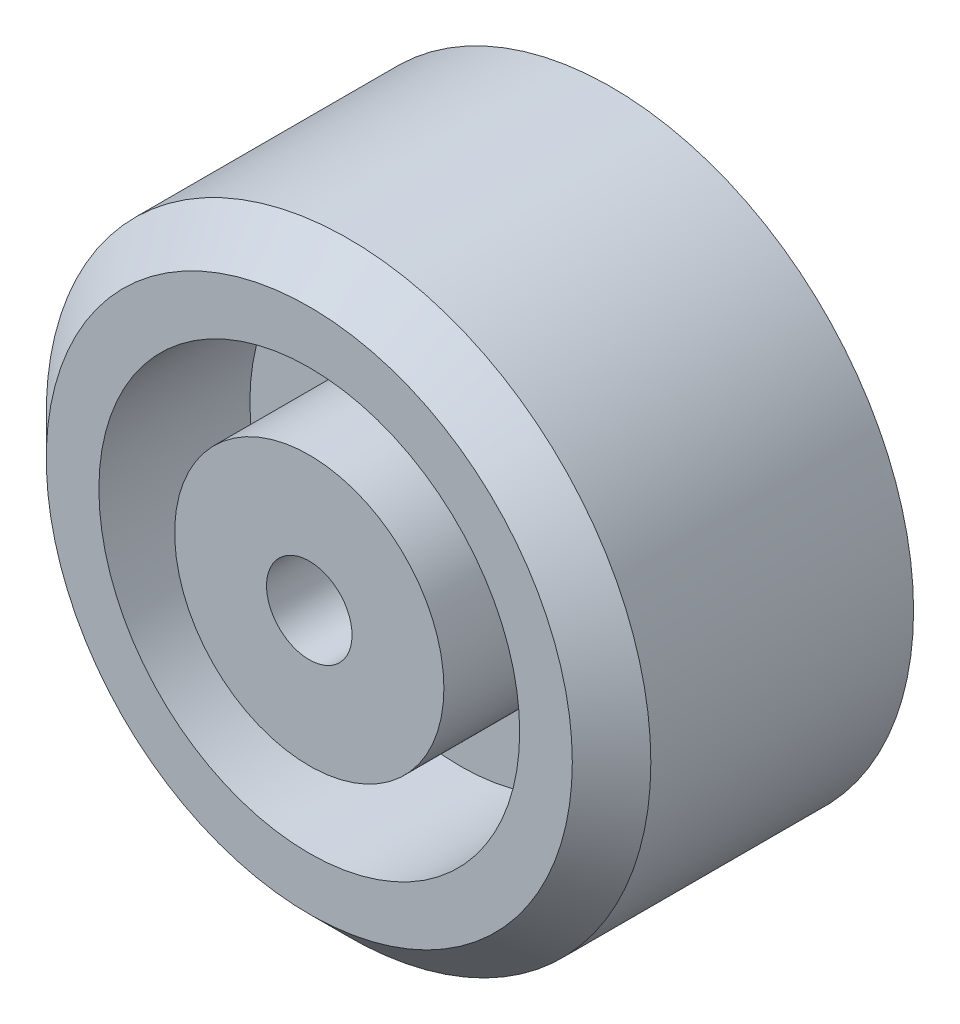
ISO-10303-21;
HEADER;
FILE_DESCRIPTION(('STEP AP214'),'2;1');
FILE_NAME('part.step','',(''),(''),'','','');
FILE_SCHEMA(('AUTOMOTIVE_DESIGN { 1 0 10303 214 1 1 1 1 }'));
ENDSEC;
DATA;
#1=APPLICATION_CONTEXT('core data for automotive mechanical design processes');
#2=APPLICATION_PROTOCOL_DEFINITION('international standard','automotive_design',2000,#1);
#3=PRODUCT_CONTEXT('',#1,'mechanical');
#4=PRODUCT('Part','Part','',(#3));
#5=PRODUCT_RELATED_PRODUCT_CATEGORY('part','',(#4));
#6=PRODUCT_DEFINITION_FORMATION('','',#4);
#7=PRODUCT_DEFINITION_CONTEXT('part definition',#1,'design');
#8=PRODUCT_DEFINITION('design','',#6,#7);
#9=PRODUCT_DEFINITION_SHAPE('','',#8);
#10=(LENGTH_UNIT() NAMED_UNIT(*) SI_UNIT(.MILLI.,.METRE.));
#11=(NAMED_UNIT(*) PLANE_ANGLE_UNIT() SI_UNIT($,.RADIAN.));
#12=(NAMED_UNIT(*) SI_UNIT($,.STERADIAN.) SOLID_ANGLE_UNIT());
#13=UNCERTAINTY_MEASURE_WITH_UNIT(LENGTH_MEASURE(1.E-05),#10,'distance_accuracy_value','');
#14=(GEOMETRIC_REPRESENTATION_CONTEXT(3) GLOBAL_UNCERTAINTY_ASSIGNED_CONTEXT((#13)) GLOBAL_UNIT_ASSIGNED_CONTEXT((#10,
#11,#12)) REPRESENTATION_CONTEXT('',''));
#15=CARTESIAN_POINT('',(0.,0.,0.));
#16=DIRECTION('',(0.,0.,1.));
#17=DIRECTION('',(1.,0.,0.));
#18=AXIS2_PLACEMENT_3D('',#15,#16,#17);
#19=CARTESIAN_POINT('',(-9.1006627591492,10.6632075471698,10.));
#20=DIRECTION('',(0.,0.,1.));
#21=DIRECTION('',(1.,0.,0.));
#22=AXIS2_PLACEMENT_3D('',#19,#20,#21);
#23=PLANE('',#22);
#24=CARTESIAN_POINT('',(-9.1006627591492,10.6632075471698,10.));
#25=DIRECTION('',(0.,0.,1.));
#26=DIRECTION('',(1.,0.,0.));
#27=AXIS2_PLACEMENT_3D('',#24,#25,#26);
#28=CIRCLE('',#27,1.41539314546252);
#29=CARTESIAN_POINT('',(-7.68526961368668,10.6632075471698,10.));
#30=VERTEX_POINT('',#29);
#31=EDGE_CURVE('E46',#30,#30,#28,.T.);
#32=ORIENTED_EDGE('',*,*,#31,.F.);
#33=EDGE_LOOP('',(#32));
#34=FACE_BOUND('',#33,.T.);
#35=CARTESIAN_POINT('',(-9.1006627591492,10.6632075471698,10.));
#36=DIRECTION('',(0.,0.,1.));
#37=DIRECTION('',(1.,0.,0.));
#38=AXIS2_PLACEMENT_3D('',#35,#36,#37);
#39=CIRCLE('',#38,4.45751214195865);
#40=CARTESIAN_POINT('',(-4.64315061719055,10.6632075471698,10.));
#41=VERTEX_POINT('',#40);
#42=EDGE_CURVE('E61',#41,#41,#39,.T.);
#43=ORIENTED_EDGE('',*,*,#42,.T.);
#44=EDGE_LOOP('',(#43));
#45=FACE_BOUND('',#44,.T.);
#46=ADVANCED_FACE('F31',(#34,#45),#23,.T.);
#47=CARTESIAN_POINT('',(-9.1006627591492,10.6632075471698,10.));
#48=DIRECTION('',(0.,0.,1.));
#49=DIRECTION('',(1.,0.,0.));
#50=AXIS2_PLACEMENT_3D('',#47,#48,#49);
#51=CIRCLE('',#50,8.70980384499657);
#52=CARTESIAN_POINT('',(-0.390858914152629,10.6632075471698,10.));
#53=VERTEX_POINT('',#52);
#54=EDGE_CURVE('E38',#53,#53,#51,.T.);
#55=ORIENTED_EDGE('',*,*,#54,.T.);
#56=EDGE_LOOP('',(#55));
#57=FACE_BOUND('',#56,.T.);
#58=CARTESIAN_POINT('',(-9.1006627591492,10.6632075471698,10.));
#59=DIRECTION('',(0.,0.,1.));
#60=DIRECTION('',(1.,0.,0.));
#61=AXIS2_PLACEMENT_3D('',#58,#59,#60);
#62=CIRCLE('',#61,6.96699452783226);
#63=CARTESIAN_POINT('',(-2.13366823131693,10.6632075471698,10.));
#64=VERTEX_POINT('',#63);
#65=EDGE_CURVE('E55',#64,#64,#62,.T.);
#66=ORIENTED_EDGE('',*,*,#65,.F.);
#67=EDGE_LOOP('',(#66));
#68=FACE_BOUND('',#67,.T.);
#69=ADVANCED_FACE('F83',(#57,#68),#23,.T.);
#70=CARTESIAN_POINT('',(-9.1006627591492,10.6632075471698,0.));
#71=DIRECTION('',(0.,0.,1.));
#72=DIRECTION('',(1.,0.,0.));
#73=AXIS2_PLACEMENT_3D('',#70,#71,#72);
#74=PLANE('',#73);
#75=CARTESIAN_POINT('',(-9.1006627591492,10.6632075471698,0.));
#76=DIRECTION('',(0.,0.,1.));
#77=DIRECTION('',(1.,0.,0.));
#78=AXIS2_PLACEMENT_3D('',#75,#76,#77);
#79=CIRCLE('',#78,10.0098038449966);
#80=CARTESIAN_POINT('',(0.909141085847382,10.6632075471698,0.));
#81=VERTEX_POINT('',#80);
#82=EDGE_CURVE('E42',#81,#81,#79,.T.);
#83=ORIENTED_EDGE('',*,*,#82,.F.);
#84=EDGE_LOOP('',(#83));
#85=FACE_BOUND('',#84,.T.);
#86=CARTESIAN_POINT('',(-9.1006627591492,10.6632075471698,0.));
#87=DIRECTION('',(0.,0.,1.));
#88=DIRECTION('',(1.,0.,0.));
#89=AXIS2_PLACEMENT_3D('',#86,#87,#88);
#90=CIRCLE('',#89,1.41539314546252);
#91=CARTESIAN_POINT('',(-7.68526961368668,10.6632075471698,0.));
#92=VERTEX_POINT('',#91);
#93=EDGE_CURVE('E49',#92,#92,#90,.T.);
#94=ORIENTED_EDGE('',*,*,#93,.T.);
#95=EDGE_LOOP('',(#94));
#96=FACE_BOUND('',#95,.T.);
#97=ADVANCED_FACE('F85',(#85,#96),#74,.F.);
#98=CARTESIAN_POINT('',(-9.1006627591492,10.6632075471698,10.));
#99=DIRECTION('',(0.,0.,-1.));
#100=DIRECTION('',(-1.,0.,0.));
#101=AXIS2_PLACEMENT_3D('',#98,#99,#100);
#102=CYLINDRICAL_SURFACE('',#101,10.0098038449966);
#103=CARTESIAN_POINT('',(-9.1006627591492,10.6632075471698,8.69999999999998));
#104=DIRECTION('',(0.,0.,1.));
#105=DIRECTION('',(1.,0.,0.));
#106=AXIS2_PLACEMENT_3D('',#103,#104,#105);
#107=CIRCLE('',#106,10.0098038449966);
#108=CARTESIAN_POINT('',(0.909141085847382,10.6632075471698,8.69999999999998));
#109=VERTEX_POINT('',#108);
#110=EDGE_CURVE('E10',#109,#109,#107,.F.);
#111=ORIENTED_EDGE('',*,*,#110,.T.);
#112=EDGE_LOOP('',(#111));
#113=FACE_BOUND('',#112,.T.);
#114=ORIENTED_EDGE('',*,*,#82,.T.);
#115=EDGE_LOOP('',(#114));
#116=FACE_BOUND('',#115,.T.);
#117=ADVANCED_FACE('F91',(#113,#116),#102,.T.);
#118=CARTESIAN_POINT('',(-9.1006627591492,10.6632075471698,10.));
#119=DIRECTION('',(0.,0.,-1.));
#120=DIRECTION('',(-1.,0.,0.));
#121=AXIS2_PLACEMENT_3D('',#118,#119,#120);
#122=CYLINDRICAL_SURFACE('',#121,1.41539314546252);
#123=ORIENTED_EDGE('',*,*,#31,.T.);
#124=EDGE_LOOP('',(#123));
#125=FACE_BOUND('',#124,.T.);
#126=ORIENTED_EDGE('',*,*,#93,.F.);
#127=EDGE_LOOP('',(#126));
#128=FACE_BOUND('',#127,.T.);
#129=ADVANCED_FACE('F79',(#125,#128),#122,.F.);
#130=CARTESIAN_POINT('',(-9.1006627591492,10.6632075471698,5.));
#131=DIRECTION('',(0.,0.,1.));
#132=DIRECTION('',(1.,0.,0.));
#133=AXIS2_PLACEMENT_3D('',#130,#131,#132);
#134=CYLINDRICAL_SURFACE('',#133,6.96699452783226);
#135=CARTESIAN_POINT('',(-9.1006627591492,10.6632075471698,5.));
#136=DIRECTION('',(0.,0.,1.));
#137=DIRECTION('',(1.,0.,0.));
#138=AXIS2_PLACEMENT_3D('',#135,#136,#137);
#139=CIRCLE('',#138,6.96699452783226);
#140=CARTESIAN_POINT('',(-2.13366823131693,10.6632075471698,5.));
#141=VERTEX_POINT('',#140);
#142=EDGE_CURVE('E52',#141,#141,#139,.T.);
#143=ORIENTED_EDGE('',*,*,#142,.F.);
#144=EDGE_LOOP('',(#143));
#145=FACE_BOUND('',#144,.T.);
#146=ORIENTED_EDGE('',*,*,#65,.T.);
#147=EDGE_LOOP('',(#146));
#148=FACE_BOUND('',#147,.T.);
#149=ADVANCED_FACE('F73',(#145,#148),#134,.F.);
#150=CARTESIAN_POINT('',(-9.1006627591492,10.6632075471698,5.));
#151=DIRECTION('',(0.,0.,1.));
#152=DIRECTION('',(1.,0.,0.));
#153=AXIS2_PLACEMENT_3D('',#150,#151,#152);
#154=PLANE('',#153);
#155=CARTESIAN_POINT('',(-9.1006627591492,10.6632075471698,5.));
#156=DIRECTION('',(0.,0.,1.));
#157=DIRECTION('',(1.,0.,0.));
#158=AXIS2_PLACEMENT_3D('',#155,#156,#157);
#159=CIRCLE('',#158,4.45751214195865);
#160=CARTESIAN_POINT('',(-4.64315061719055,10.6632075471698,5.));
#161=VERTEX_POINT('',#160);
#162=EDGE_CURVE('E58',#161,#161,#159,.T.);
#163=ORIENTED_EDGE('',*,*,#162,.F.);
#164=EDGE_LOOP('',(#163));
#165=FACE_BOUND('',#164,.T.);
#166=ORIENTED_EDGE('',*,*,#142,.T.);
#167=EDGE_LOOP('',(#166));
#168=FACE_BOUND('',#167,.T.);
#169=ADVANCED_FACE('F70',(#165,#168),#154,.T.);
#170=CARTESIAN_POINT('',(-9.1006627591492,10.6632075471698,5.));
#171=DIRECTION('',(0.,0.,1.));
#172=DIRECTION('',(1.,0.,0.));
#173=AXIS2_PLACEMENT_3D('',#170,#171,#172);
#174=CYLINDRICAL_SURFACE('',#173,4.45751214195865);
#175=ORIENTED_EDGE('',*,*,#162,.T.);
#176=EDGE_LOOP('',(#175));
#177=FACE_BOUND('',#176,.T.);
#178=ORIENTED_EDGE('',*,*,#42,.F.);
#179=EDGE_LOOP('',(#178));
#180=FACE_BOUND('',#179,.T.);
#181=ADVANCED_FACE('F67',(#177,#180),#174,.T.);
#182=CARTESIAN_POINT('',(-9.1006627591492,10.6632075471698,10.));
#183=DIRECTION('',(0.,0.,-1.));
#184=DIRECTION('',(-1.,0.,0.));
#185=AXIS2_PLACEMENT_3D('',#182,#183,#184);
#186=CONICAL_SURFACE('',#185,8.70980384499657,0.785398163397445);
#187=ORIENTED_EDGE('',*,*,#110,.F.);
#188=EDGE_LOOP('',(#187));
#189=FACE_BOUND('',#188,.T.);
#190=ORIENTED_EDGE('',*,*,#54,.F.);
#191=EDGE_LOOP('',(#190));
#192=FACE_BOUND('',#191,.T.);
#193=ADVANCED_FACE('F33',(#189,#192),#186,.T.);
#194=CLOSED_SHELL('',(#46,#69,#97,#117,#129,#149,#169,#181,#193));
#195=MANIFOLD_SOLID_BREP('B2',#194);
#196=ADVANCED_BREP_SHAPE_REPRESENTATION('',(#18,#195),#14);
#197=SHAPE_DEFINITION_REPRESENTATION(#9,#196);
ENDSEC;
END-ISO-10303-21;
